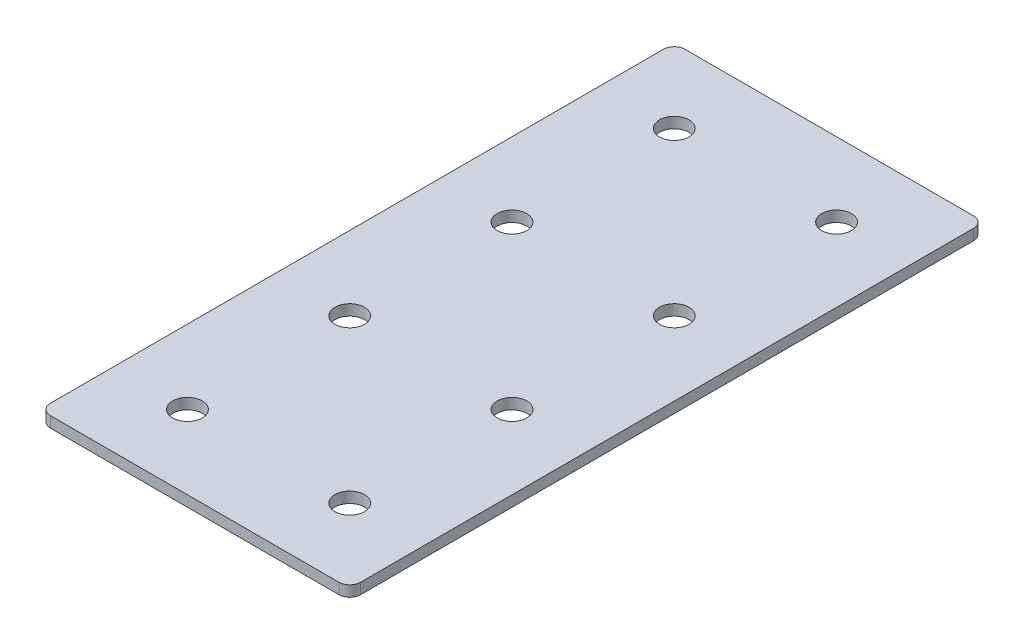
ISO-10303-21;
HEADER;
FILE_DESCRIPTION(('STEP AP214'),'2;1');
FILE_NAME('part.step','',(''),(''),'','','');
FILE_SCHEMA(('AUTOMOTIVE_DESIGN { 1 0 10303 214 1 1 1 1 }'));
ENDSEC;
DATA;
#1=APPLICATION_CONTEXT('core data for automotive mechanical design processes');
#2=APPLICATION_PROTOCOL_DEFINITION('international standard','automotive_design',2000,#1);
#3=PRODUCT_CONTEXT('',#1,'mechanical');
#4=PRODUCT('Part','Part','',(#3));
#5=PRODUCT_RELATED_PRODUCT_CATEGORY('part','',(#4));
#6=PRODUCT_DEFINITION_FORMATION('','',#4);
#7=PRODUCT_DEFINITION_CONTEXT('part definition',#1,'design');
#8=PRODUCT_DEFINITION('design','',#6,#7);
#9=PRODUCT_DEFINITION_SHAPE('','',#8);
#10=(LENGTH_UNIT() NAMED_UNIT(*) SI_UNIT(.MILLI.,.METRE.));
#11=(NAMED_UNIT(*) PLANE_ANGLE_UNIT() SI_UNIT($,.RADIAN.));
#12=(NAMED_UNIT(*) SI_UNIT($,.STERADIAN.) SOLID_ANGLE_UNIT());
#13=UNCERTAINTY_MEASURE_WITH_UNIT(LENGTH_MEASURE(1.E-05),#10,'distance_accuracy_value','');
#14=(GEOMETRIC_REPRESENTATION_CONTEXT(3) GLOBAL_UNCERTAINTY_ASSIGNED_CONTEXT((#13)) GLOBAL_UNIT_ASSIGNED_CONTEXT((#10,
#11,#12)) REPRESENTATION_CONTEXT('',''));
#15=CARTESIAN_POINT('',(0.,0.,0.));
#16=DIRECTION('',(0.,0.,1.));
#17=DIRECTION('',(1.,0.,0.));
#18=AXIS2_PLACEMENT_3D('',#15,#16,#17);
#19=CARTESIAN_POINT('',(-1.93702400832763,1.42462627726309,-68.4871269738255));
#20=DIRECTION('',(0.,-1.,0.));
#21=DIRECTION('',(0.,0.,-1.));
#22=AXIS2_PLACEMENT_3D('',#19,#20,#21);
#23=PLANE('',#22);
#24=CARTESIAN_POINT('',(20.5629759916724,1.42462627726309,66.5128730261745));
#25=DIRECTION('',(0.,1.,0.));
#26=DIRECTION('',(0.,0.,1.));
#27=AXIS2_PLACEMENT_3D('',#24,#25,#26);
#28=CIRCLE('',#27,4.1);
#29=CARTESIAN_POINT('',(20.5629759916724,1.42462627726309,70.6128730261745));
#30=VERTEX_POINT('',#29);
#31=EDGE_CURVE('E189',#30,#30,#28,.T.);
#32=ORIENTED_EDGE('',*,*,#31,.T.);
#33=EDGE_LOOP('',(#32));
#34=FACE_BOUND('',#33,.T.);
#35=CARTESIAN_POINT('',(-24.4370240083277,1.42462627726309,66.5128730261745));
#36=DIRECTION('',(0.,1.,0.));
#37=DIRECTION('',(0.,0.,1.));
#38=AXIS2_PLACEMENT_3D('',#35,#36,#37);
#39=CIRCLE('',#38,4.1);
#40=CARTESIAN_POINT('',(-24.4370240083277,1.42462627726309,70.6128730261745));
#41=VERTEX_POINT('',#40);
#42=EDGE_CURVE('E183',#41,#41,#39,.T.);
#43=ORIENTED_EDGE('',*,*,#42,.T.);
#44=EDGE_LOOP('',(#43));
#45=FACE_BOUND('',#44,.T.);
#46=CARTESIAN_POINT('',(20.5629759916724,1.42462627726309,21.5128730261745));
#47=DIRECTION('',(0.,1.,0.));
#48=DIRECTION('',(0.,0.,1.));
#49=AXIS2_PLACEMENT_3D('',#46,#47,#48);
#50=CIRCLE('',#49,4.1);
#51=CARTESIAN_POINT('',(20.5629759916724,1.42462627726309,25.6128730261745));
#52=VERTEX_POINT('',#51);
#53=EDGE_CURVE('E177',#52,#52,#50,.T.);
#54=ORIENTED_EDGE('',*,*,#53,.T.);
#55=EDGE_LOOP('',(#54));
#56=FACE_BOUND('',#55,.T.);
#57=CARTESIAN_POINT('',(-24.4370240083277,1.42462627726309,21.5128730261745));
#58=DIRECTION('',(0.,1.,0.));
#59=DIRECTION('',(0.,0.,1.));
#60=AXIS2_PLACEMENT_3D('',#57,#58,#59);
#61=CIRCLE('',#60,4.1);
#62=CARTESIAN_POINT('',(-24.4370240083277,1.42462627726309,25.6128730261745));
#63=VERTEX_POINT('',#62);
#64=EDGE_CURVE('E171',#63,#63,#61,.T.);
#65=ORIENTED_EDGE('',*,*,#64,.T.);
#66=EDGE_LOOP('',(#65));
#67=FACE_BOUND('',#66,.T.);
#68=CARTESIAN_POINT('',(20.5629759916724,1.42462627726309,-23.4871269738255));
#69=DIRECTION('',(0.,1.,0.));
#70=DIRECTION('',(0.,0.,1.));
#71=AXIS2_PLACEMENT_3D('',#68,#69,#70);
#72=CIRCLE('',#71,4.1);
#73=CARTESIAN_POINT('',(20.5629759916724,1.42462627726309,-19.3871269738255));
#74=VERTEX_POINT('',#73);
#75=EDGE_CURVE('E165',#74,#74,#72,.T.);
#76=ORIENTED_EDGE('',*,*,#75,.T.);
#77=EDGE_LOOP('',(#76));
#78=FACE_BOUND('',#77,.T.);
#79=CARTESIAN_POINT('',(-24.4370240083277,1.42462627726309,-23.4871269738255));
#80=DIRECTION('',(0.,1.,0.));
#81=DIRECTION('',(0.,0.,1.));
#82=AXIS2_PLACEMENT_3D('',#79,#80,#81);
#83=CIRCLE('',#82,4.1);
#84=CARTESIAN_POINT('',(-24.4370240083277,1.42462627726309,-19.3871269738255));
#85=VERTEX_POINT('',#84);
#86=EDGE_CURVE('E159',#85,#85,#83,.T.);
#87=ORIENTED_EDGE('',*,*,#86,.T.);
#88=EDGE_LOOP('',(#87));
#89=FACE_BOUND('',#88,.T.);
#90=CARTESIAN_POINT('',(20.5629759916724,1.42462627726309,-68.4871269738255));
#91=DIRECTION('',(0.,1.,0.));
#92=DIRECTION('',(0.,0.,1.));
#93=AXIS2_PLACEMENT_3D('',#90,#91,#92);
#94=CIRCLE('',#93,4.1);
#95=CARTESIAN_POINT('',(20.5629759916724,1.42462627726309,-64.3871269738255));
#96=VERTEX_POINT('',#95);
#97=EDGE_CURVE('E154',#96,#96,#94,.T.);
#98=ORIENTED_EDGE('',*,*,#97,.T.);
#99=EDGE_LOOP('',(#98));
#100=FACE_BOUND('',#99,.T.);
#101=CARTESIAN_POINT('',(-24.4370240083277,1.42462627726309,-68.4871269738255));
#102=DIRECTION('',(0.,1.,0.));
#103=DIRECTION('',(0.,0.,1.));
#104=AXIS2_PLACEMENT_3D('',#101,#102,#103);
#105=CIRCLE('',#104,4.1);
#106=CARTESIAN_POINT('',(-24.4370240083277,1.42462627726309,-64.3871269738255));
#107=VERTEX_POINT('',#106);
#108=EDGE_CURVE('E147',#107,#107,#105,.T.);
#109=ORIENTED_EDGE('',*,*,#108,.T.);
#110=EDGE_LOOP('',(#109));
#111=FACE_BOUND('',#110,.T.);
#112=DIRECTION('',(0.,0.,-1.));
#113=VECTOR('',#112,1.);
#114=CARTESIAN_POINT('',(41.0629759916725,1.42462627726309,87.0128730261745));
#115=LINE('',#114,#113);
#116=CARTESIAN_POINT('',(41.0629759916725,1.42462627726309,84.0128730261745));
#117=VERTEX_POINT('',#116);
#118=CARTESIAN_POINT('',(41.0629759916724,1.42462627726309,-85.9871269738255));
#119=VERTEX_POINT('',#118);
#120=EDGE_CURVE('E106',#117,#119,#115,.T.);
#121=ORIENTED_EDGE('',*,*,#120,.F.);
#122=CARTESIAN_POINT('',(38.0629759916725,1.42462627726309,84.0128730261745));
#123=DIRECTION('',(0.,-1.,0.));
#124=DIRECTION('',(0.,0.,-1.));
#125=AXIS2_PLACEMENT_3D('',#122,#123,#124);
#126=CIRCLE('',#125,3.);
#127=CARTESIAN_POINT('',(38.0629759916725,1.42462627726309,87.0128730261745));
#128=VERTEX_POINT('',#127);
#129=EDGE_CURVE('E128',#117,#128,#126,.T.);
#130=ORIENTED_EDGE('',*,*,#129,.T.);
#131=DIRECTION('',(1.,0.,0.));
#132=VECTOR('',#131,1.);
#133=CARTESIAN_POINT('',(-44.9370240083277,1.42462627726309,87.0128730261745));
#134=LINE('',#133,#132);
#135=CARTESIAN_POINT('',(-41.9370240083277,1.42462627726309,87.0128730261745));
#136=VERTEX_POINT('',#135);
#137=EDGE_CURVE('E110',#136,#128,#134,.T.);
#138=ORIENTED_EDGE('',*,*,#137,.F.);
#139=CARTESIAN_POINT('',(-41.9370240083277,1.42462627726309,84.0128730261745));
#140=DIRECTION('',(0.,-1.,0.));
#141=DIRECTION('',(0.,0.,-1.));
#142=AXIS2_PLACEMENT_3D('',#139,#140,#141);
#143=CIRCLE('',#142,3.);
#144=CARTESIAN_POINT('',(-44.9370240083277,1.42462627726309,84.0128730261745));
#145=VERTEX_POINT('',#144);
#146=EDGE_CURVE('E105',#136,#145,#143,.T.);
#147=ORIENTED_EDGE('',*,*,#146,.T.);
#148=DIRECTION('',(0.,0.,1.));
#149=VECTOR('',#148,1.);
#150=CARTESIAN_POINT('',(-44.9370240083277,1.42462627726309,-88.9871269738255));
#151=LINE('',#150,#149);
#152=CARTESIAN_POINT('',(-44.9370240083277,1.42462627726309,-85.9871269738255));
#153=VERTEX_POINT('',#152);
#154=EDGE_CURVE('E137',#153,#145,#151,.T.);
#155=ORIENTED_EDGE('',*,*,#154,.F.);
#156=CARTESIAN_POINT('',(-41.9370240083277,1.42462627726309,-85.9871269738255));
#157=DIRECTION('',(0.,-1.,0.));
#158=DIRECTION('',(0.,0.,-1.));
#159=AXIS2_PLACEMENT_3D('',#156,#157,#158);
#160=CIRCLE('',#159,3.);
#161=CARTESIAN_POINT('',(-41.9370240083277,1.42462627726309,-88.9871269738255));
#162=VERTEX_POINT('',#161);
#163=EDGE_CURVE('E31',#153,#162,#160,.T.);
#164=ORIENTED_EDGE('',*,*,#163,.T.);
#165=DIRECTION('',(-1.,0.,0.));
#166=VECTOR('',#165,1.);
#167=CARTESIAN_POINT('',(41.0629759916724,1.42462627726309,-88.9871269738255));
#168=LINE('',#167,#166);
#169=CARTESIAN_POINT('',(38.0629759916724,1.42462627726309,-88.9871269738255));
#170=VERTEX_POINT('',#169);
#171=EDGE_CURVE('E138',#170,#162,#168,.T.);
#172=ORIENTED_EDGE('',*,*,#171,.F.);
#173=CARTESIAN_POINT('',(38.0629759916724,1.42462627726309,-85.9871269738255));
#174=DIRECTION('',(0.,-1.,0.));
#175=DIRECTION('',(0.,0.,-1.));
#176=AXIS2_PLACEMENT_3D('',#173,#174,#175);
#177=CIRCLE('',#176,3.);
#178=EDGE_CURVE('E126',#170,#119,#177,.T.);
#179=ORIENTED_EDGE('',*,*,#178,.T.);
#180=EDGE_LOOP('',(#121,#130,#138,#147,#155,#164,#172,#179));
#181=FACE_BOUND('',#180,.T.);
#182=ADVANCED_FACE('F16',(#34,#45,#56,#67,#78,#89,#100,#111,#181),#23,.T.);
#183=CARTESIAN_POINT('',(41.0629759916724,1.42462627726309,-88.9871269738255));
#184=DIRECTION('',(0.,0.,-1.));
#185=DIRECTION('',(-1.,0.,0.));
#186=AXIS2_PLACEMENT_3D('',#183,#184,#185);
#187=PLANE('',#186);
#188=DIRECTION('',(-1.,0.,0.));
#189=VECTOR('',#188,1.);
#190=CARTESIAN_POINT('',(41.0629759916724,4.42462627726309,-88.9871269738255));
#191=LINE('',#190,#189);
#192=CARTESIAN_POINT('',(38.0629759916724,4.42462627726309,-88.9871269738255));
#193=VERTEX_POINT('',#192);
#194=CARTESIAN_POINT('',(-41.9370240083277,4.42462627726309,-88.9871269738255));
#195=VERTEX_POINT('',#194);
#196=EDGE_CURVE('E144',#193,#195,#191,.T.);
#197=ORIENTED_EDGE('',*,*,#196,.F.);
#198=DIRECTION('',(0.,1.,0.));
#199=VECTOR('',#198,1.);
#200=CARTESIAN_POINT('',(38.0629759916724,1.42462627726309,-88.9871269738255));
#201=LINE('',#200,#199);
#202=EDGE_CURVE('E38',#193,#170,#201,.F.);
#203=ORIENTED_EDGE('',*,*,#202,.T.);
#204=ORIENTED_EDGE('',*,*,#171,.T.);
#205=DIRECTION('',(0.,1.,0.));
#206=VECTOR('',#205,1.);
#207=CARTESIAN_POINT('',(-41.9370240083277,1.42462627726309,-88.9871269738255));
#208=LINE('',#207,#206);
#209=EDGE_CURVE('E130',#162,#195,#208,.T.);
#210=ORIENTED_EDGE('',*,*,#209,.T.);
#211=EDGE_LOOP('',(#197,#203,#204,#210));
#212=FACE_BOUND('',#211,.T.);
#213=ADVANCED_FACE('F239',(#212),#187,.T.);
#214=CARTESIAN_POINT('',(41.0629759916725,1.42462627726309,87.0128730261745));
#215=DIRECTION('',(1.,0.,0.));
#216=DIRECTION('',(0.,0.,-1.));
#217=AXIS2_PLACEMENT_3D('',#214,#215,#216);
#218=PLANE('',#217);
#219=DIRECTION('',(0.,0.,-1.));
#220=VECTOR('',#219,1.);
#221=CARTESIAN_POINT('',(41.0629759916725,4.42462627726309,87.0128730261745));
#222=LINE('',#221,#220);
#223=CARTESIAN_POINT('',(41.0629759916725,4.42462627726309,84.0128730261745));
#224=VERTEX_POINT('',#223);
#225=CARTESIAN_POINT('',(41.0629759916724,4.42462627726309,-85.9871269738255));
#226=VERTEX_POINT('',#225);
#227=EDGE_CURVE('E102',#224,#226,#222,.T.);
#228=ORIENTED_EDGE('',*,*,#227,.F.);
#229=DIRECTION('',(0.,1.,0.));
#230=VECTOR('',#229,1.);
#231=CARTESIAN_POINT('',(41.0629759916725,1.42462627726309,84.0128730261745));
#232=LINE('',#231,#230);
#233=EDGE_CURVE('E122',#224,#117,#232,.F.);
#234=ORIENTED_EDGE('',*,*,#233,.T.);
#235=ORIENTED_EDGE('',*,*,#120,.T.);
#236=DIRECTION('',(0.,1.,0.));
#237=VECTOR('',#236,1.);
#238=CARTESIAN_POINT('',(41.0629759916724,1.42462627726309,-85.9871269738255));
#239=LINE('',#238,#237);
#240=EDGE_CURVE('E119',#119,#226,#239,.T.);
#241=ORIENTED_EDGE('',*,*,#240,.T.);
#242=EDGE_LOOP('',(#228,#234,#235,#241));
#243=FACE_BOUND('',#242,.T.);
#244=ADVANCED_FACE('F244',(#243),#218,.T.);
#245=CARTESIAN_POINT('',(-44.9370240083277,1.42462627726309,87.0128730261745));
#246=DIRECTION('',(0.,0.,1.));
#247=DIRECTION('',(1.,0.,0.));
#248=AXIS2_PLACEMENT_3D('',#245,#246,#247);
#249=PLANE('',#248);
#250=ORIENTED_EDGE('',*,*,#137,.T.);
#251=DIRECTION('',(0.,1.,0.));
#252=VECTOR('',#251,1.);
#253=CARTESIAN_POINT('',(38.0629759916725,1.42462627726309,87.0128730261745));
#254=LINE('',#253,#252);
#255=CARTESIAN_POINT('',(38.0629759916725,4.42462627726309,87.0128730261745));
#256=VERTEX_POINT('',#255);
#257=EDGE_CURVE('E93',#128,#256,#254,.T.);
#258=ORIENTED_EDGE('',*,*,#257,.T.);
#259=DIRECTION('',(1.,0.,0.));
#260=VECTOR('',#259,1.);
#261=CARTESIAN_POINT('',(-44.9370240083277,4.42462627726309,87.0128730261745));
#262=LINE('',#261,#260);
#263=CARTESIAN_POINT('',(-41.9370240083277,4.42462627726309,87.0128730261745));
#264=VERTEX_POINT('',#263);
#265=EDGE_CURVE('E85',#264,#256,#262,.T.);
#266=ORIENTED_EDGE('',*,*,#265,.F.);
#267=DIRECTION('',(0.,1.,0.));
#268=VECTOR('',#267,1.);
#269=CARTESIAN_POINT('',(-41.9370240083277,1.42462627726309,87.0128730261745));
#270=LINE('',#269,#268);
#271=EDGE_CURVE('E99',#264,#136,#270,.F.);
#272=ORIENTED_EDGE('',*,*,#271,.T.);
#273=EDGE_LOOP('',(#250,#258,#266,#272));
#274=FACE_BOUND('',#273,.T.);
#275=ADVANCED_FACE('F98',(#274),#249,.T.);
#276=CARTESIAN_POINT('',(-44.9370240083277,1.42462627726309,-88.9871269738255));
#277=DIRECTION('',(-1.,0.,0.));
#278=DIRECTION('',(0.,0.,1.));
#279=AXIS2_PLACEMENT_3D('',#276,#277,#278);
#280=PLANE('',#279);
#281=DIRECTION('',(0.,0.,1.));
#282=VECTOR('',#281,1.);
#283=CARTESIAN_POINT('',(-44.9370240083277,4.42462627726309,-88.9871269738255));
#284=LINE('',#283,#282);
#285=CARTESIAN_POINT('',(-44.9370240083277,4.42462627726309,-85.9871269738255));
#286=VERTEX_POINT('',#285);
#287=CARTESIAN_POINT('',(-44.9370240083277,4.42462627726309,84.0128730261745));
#288=VERTEX_POINT('',#287);
#289=EDGE_CURVE('E87',#286,#288,#284,.T.);
#290=ORIENTED_EDGE('',*,*,#289,.F.);
#291=DIRECTION('',(0.,1.,0.));
#292=VECTOR('',#291,1.);
#293=CARTESIAN_POINT('',(-44.9370240083277,1.42462627726309,-85.9871269738255));
#294=LINE('',#293,#292);
#295=EDGE_CURVE('E10',#286,#153,#294,.F.);
#296=ORIENTED_EDGE('',*,*,#295,.T.);
#297=ORIENTED_EDGE('',*,*,#154,.T.);
#298=DIRECTION('',(0.,1.,0.));
#299=VECTOR('',#298,1.);
#300=CARTESIAN_POINT('',(-44.9370240083277,1.42462627726309,84.0128730261745));
#301=LINE('',#300,#299);
#302=EDGE_CURVE('E24',#145,#288,#301,.T.);
#303=ORIENTED_EDGE('',*,*,#302,.T.);
#304=EDGE_LOOP('',(#290,#296,#297,#303));
#305=FACE_BOUND('',#304,.T.);
#306=ADVANCED_FACE('F135',(#305),#280,.T.);
#307=CARTESIAN_POINT('',(-1.93702400832763,4.42462627726309,-68.4871269738255));
#308=DIRECTION('',(0.,-1.,0.));
#309=DIRECTION('',(0.,0.,-1.));
#310=AXIS2_PLACEMENT_3D('',#307,#308,#309);
#311=PLANE('',#310);
#312=CARTESIAN_POINT('',(20.5629759916724,4.42462627726309,66.5128730261745));
#313=DIRECTION('',(0.,1.,0.));
#314=DIRECTION('',(0.,0.,1.));
#315=AXIS2_PLACEMENT_3D('',#312,#313,#314);
#316=CIRCLE('',#315,4.1);
#317=CARTESIAN_POINT('',(20.5629759916724,4.42462627726309,70.6128730261745));
#318=VERTEX_POINT('',#317);
#319=EDGE_CURVE('E192',#318,#318,#316,.T.);
#320=ORIENTED_EDGE('',*,*,#319,.F.);
#321=EDGE_LOOP('',(#320));
#322=FACE_BOUND('',#321,.T.);
#323=CARTESIAN_POINT('',(-24.4370240083277,4.42462627726309,66.5128730261745));
#324=DIRECTION('',(0.,1.,0.));
#325=DIRECTION('',(0.,0.,1.));
#326=AXIS2_PLACEMENT_3D('',#323,#324,#325);
#327=CIRCLE('',#326,4.1);
#328=CARTESIAN_POINT('',(-24.4370240083277,4.42462627726309,70.6128730261745));
#329=VERTEX_POINT('',#328);
#330=EDGE_CURVE('E186',#329,#329,#327,.T.);
#331=ORIENTED_EDGE('',*,*,#330,.F.);
#332=EDGE_LOOP('',(#331));
#333=FACE_BOUND('',#332,.T.);
#334=CARTESIAN_POINT('',(20.5629759916724,4.42462627726309,21.5128730261745));
#335=DIRECTION('',(0.,1.,0.));
#336=DIRECTION('',(0.,0.,1.));
#337=AXIS2_PLACEMENT_3D('',#334,#335,#336);
#338=CIRCLE('',#337,4.1);
#339=CARTESIAN_POINT('',(20.5629759916724,4.42462627726309,25.6128730261745));
#340=VERTEX_POINT('',#339);
#341=EDGE_CURVE('E180',#340,#340,#338,.T.);
#342=ORIENTED_EDGE('',*,*,#341,.F.);
#343=EDGE_LOOP('',(#342));
#344=FACE_BOUND('',#343,.T.);
#345=CARTESIAN_POINT('',(-24.4370240083277,4.42462627726309,21.5128730261745));
#346=DIRECTION('',(0.,1.,0.));
#347=DIRECTION('',(0.,0.,1.));
#348=AXIS2_PLACEMENT_3D('',#345,#346,#347);
#349=CIRCLE('',#348,4.1);
#350=CARTESIAN_POINT('',(-24.4370240083277,4.42462627726309,25.6128730261745));
#351=VERTEX_POINT('',#350);
#352=EDGE_CURVE('E174',#351,#351,#349,.T.);
#353=ORIENTED_EDGE('',*,*,#352,.F.);
#354=EDGE_LOOP('',(#353));
#355=FACE_BOUND('',#354,.T.);
#356=CARTESIAN_POINT('',(20.5629759916724,4.42462627726309,-23.4871269738255));
#357=DIRECTION('',(0.,1.,0.));
#358=DIRECTION('',(0.,0.,1.));
#359=AXIS2_PLACEMENT_3D('',#356,#357,#358);
#360=CIRCLE('',#359,4.1);
#361=CARTESIAN_POINT('',(20.5629759916724,4.42462627726309,-19.3871269738255));
#362=VERTEX_POINT('',#361);
#363=EDGE_CURVE('E168',#362,#362,#360,.T.);
#364=ORIENTED_EDGE('',*,*,#363,.F.);
#365=EDGE_LOOP('',(#364));
#366=FACE_BOUND('',#365,.T.);
#367=CARTESIAN_POINT('',(-24.4370240083277,4.42462627726309,-23.4871269738255));
#368=DIRECTION('',(0.,1.,0.));
#369=DIRECTION('',(0.,0.,1.));
#370=AXIS2_PLACEMENT_3D('',#367,#368,#369);
#371=CIRCLE('',#370,4.1);
#372=CARTESIAN_POINT('',(-24.4370240083277,4.42462627726309,-19.3871269738255));
#373=VERTEX_POINT('',#372);
#374=EDGE_CURVE('E162',#373,#373,#371,.T.);
#375=ORIENTED_EDGE('',*,*,#374,.F.);
#376=EDGE_LOOP('',(#375));
#377=FACE_BOUND('',#376,.T.);
#378=CARTESIAN_POINT('',(20.5629759916724,4.42462627726309,-68.4871269738255));
#379=DIRECTION('',(0.,1.,0.));
#380=DIRECTION('',(0.,0.,1.));
#381=AXIS2_PLACEMENT_3D('',#378,#379,#380);
#382=CIRCLE('',#381,4.1);
#383=CARTESIAN_POINT('',(20.5629759916724,4.42462627726309,-64.3871269738255));
#384=VERTEX_POINT('',#383);
#385=EDGE_CURVE('E156',#384,#384,#382,.T.);
#386=ORIENTED_EDGE('',*,*,#385,.F.);
#387=EDGE_LOOP('',(#386));
#388=FACE_BOUND('',#387,.T.);
#389=CARTESIAN_POINT('',(-24.4370240083277,4.42462627726309,-68.4871269738255));
#390=DIRECTION('',(0.,1.,0.));
#391=DIRECTION('',(0.,0.,1.));
#392=AXIS2_PLACEMENT_3D('',#389,#390,#391);
#393=CIRCLE('',#392,4.1);
#394=CARTESIAN_POINT('',(-24.4370240083277,4.42462627726309,-64.3871269738255));
#395=VERTEX_POINT('',#394);
#396=EDGE_CURVE('E149',#395,#395,#393,.T.);
#397=ORIENTED_EDGE('',*,*,#396,.F.);
#398=EDGE_LOOP('',(#397));
#399=FACE_BOUND('',#398,.T.);
#400=ORIENTED_EDGE('',*,*,#265,.T.);
#401=CARTESIAN_POINT('',(38.0629759916725,4.42462627726309,84.0128730261745));
#402=DIRECTION('',(0.,-1.,0.));
#403=DIRECTION('',(0.,0.,-1.));
#404=AXIS2_PLACEMENT_3D('',#401,#402,#403);
#405=CIRCLE('',#404,3.);
#406=EDGE_CURVE('E117',#256,#224,#405,.F.);
#407=ORIENTED_EDGE('',*,*,#406,.T.);
#408=ORIENTED_EDGE('',*,*,#227,.T.);
#409=CARTESIAN_POINT('',(38.0629759916724,4.42462627726309,-85.9871269738255));
#410=DIRECTION('',(0.,-1.,0.));
#411=DIRECTION('',(0.,0.,-1.));
#412=AXIS2_PLACEMENT_3D('',#409,#410,#411);
#413=CIRCLE('',#412,3.);
#414=EDGE_CURVE('E115',#226,#193,#413,.F.);
#415=ORIENTED_EDGE('',*,*,#414,.T.);
#416=ORIENTED_EDGE('',*,*,#196,.T.);
#417=CARTESIAN_POINT('',(-41.9370240083277,4.42462627726309,-85.9871269738255));
#418=DIRECTION('',(0.,-1.,0.));
#419=DIRECTION('',(0.,0.,-1.));
#420=AXIS2_PLACEMENT_3D('',#417,#418,#419);
#421=CIRCLE('',#420,3.);
#422=EDGE_CURVE('E92',#195,#286,#421,.F.);
#423=ORIENTED_EDGE('',*,*,#422,.T.);
#424=ORIENTED_EDGE('',*,*,#289,.T.);
#425=CARTESIAN_POINT('',(-41.9370240083277,4.42462627726309,84.0128730261745));
#426=DIRECTION('',(0.,-1.,0.));
#427=DIRECTION('',(0.,0.,-1.));
#428=AXIS2_PLACEMENT_3D('',#425,#426,#427);
#429=CIRCLE('',#428,3.);
#430=EDGE_CURVE('E82',#288,#264,#429,.F.);
#431=ORIENTED_EDGE('',*,*,#430,.T.);
#432=EDGE_LOOP('',(#400,#407,#408,#415,#416,#423,#424,#431));
#433=FACE_BOUND('',#432,.T.);
#434=ADVANCED_FACE('F84',(#322,#333,#344,#355,#366,#377,#388,#399,#433),#311,.F.);
#435=CARTESIAN_POINT('',(-24.4370240083277,1.42462627726309,-68.4871269738255));
#436=DIRECTION('',(0.,1.,0.));
#437=DIRECTION('',(0.,0.,1.));
#438=AXIS2_PLACEMENT_3D('',#435,#436,#437);
#439=CYLINDRICAL_SURFACE('',#438,4.1);
#440=ORIENTED_EDGE('',*,*,#108,.F.);
#441=EDGE_LOOP('',(#440));
#442=FACE_BOUND('',#441,.T.);
#443=ORIENTED_EDGE('',*,*,#396,.T.);
#444=EDGE_LOOP('',(#443));
#445=FACE_BOUND('',#444,.T.);
#446=ADVANCED_FACE('F210',(#442,#445),#439,.F.);
#447=CARTESIAN_POINT('',(20.5629759916724,1.42462627726309,-68.4871269738255));
#448=DIRECTION('',(0.,1.,0.));
#449=DIRECTION('',(0.,0.,1.));
#450=AXIS2_PLACEMENT_3D('',#447,#448,#449);
#451=CYLINDRICAL_SURFACE('',#450,4.1);
#452=ORIENTED_EDGE('',*,*,#97,.F.);
#453=EDGE_LOOP('',(#452));
#454=FACE_BOUND('',#453,.T.);
#455=ORIENTED_EDGE('',*,*,#385,.T.);
#456=EDGE_LOOP('',(#455));
#457=FACE_BOUND('',#456,.T.);
#458=ADVANCED_FACE('F227',(#454,#457),#451,.F.);
#459=CARTESIAN_POINT('',(-24.4370240083277,1.42462627726309,-23.4871269738255));
#460=DIRECTION('',(0.,1.,0.));
#461=DIRECTION('',(0.,0.,1.));
#462=AXIS2_PLACEMENT_3D('',#459,#460,#461);
#463=CYLINDRICAL_SURFACE('',#462,4.1);
#464=ORIENTED_EDGE('',*,*,#86,.F.);
#465=EDGE_LOOP('',(#464));
#466=FACE_BOUND('',#465,.T.);
#467=ORIENTED_EDGE('',*,*,#374,.T.);
#468=EDGE_LOOP('',(#467));
#469=FACE_BOUND('',#468,.T.);
#470=ADVANCED_FACE('F234',(#466,#469),#463,.F.);
#471=CARTESIAN_POINT('',(20.5629759916724,1.42462627726309,-23.4871269738255));
#472=DIRECTION('',(0.,1.,0.));
#473=DIRECTION('',(0.,0.,1.));
#474=AXIS2_PLACEMENT_3D('',#471,#472,#473);
#475=CYLINDRICAL_SURFACE('',#474,4.1);
#476=ORIENTED_EDGE('',*,*,#75,.F.);
#477=EDGE_LOOP('',(#476));
#478=FACE_BOUND('',#477,.T.);
#479=ORIENTED_EDGE('',*,*,#363,.T.);
#480=EDGE_LOOP('',(#479));
#481=FACE_BOUND('',#480,.T.);
#482=ADVANCED_FACE('F307',(#478,#481),#475,.F.);
#483=CARTESIAN_POINT('',(-24.4370240083277,1.42462627726309,21.5128730261745));
#484=DIRECTION('',(0.,1.,0.));
#485=DIRECTION('',(0.,0.,1.));
#486=AXIS2_PLACEMENT_3D('',#483,#484,#485);
#487=CYLINDRICAL_SURFACE('',#486,4.1);
#488=ORIENTED_EDGE('',*,*,#64,.F.);
#489=EDGE_LOOP('',(#488));
#490=FACE_BOUND('',#489,.T.);
#491=ORIENTED_EDGE('',*,*,#352,.T.);
#492=EDGE_LOOP('',(#491));
#493=FACE_BOUND('',#492,.T.);
#494=ADVANCED_FACE('F317',(#490,#493),#487,.F.);
#495=CARTESIAN_POINT('',(20.5629759916724,1.42462627726309,21.5128730261745));
#496=DIRECTION('',(0.,1.,0.));
#497=DIRECTION('',(0.,0.,1.));
#498=AXIS2_PLACEMENT_3D('',#495,#496,#497);
#499=CYLINDRICAL_SURFACE('',#498,4.1);
#500=ORIENTED_EDGE('',*,*,#53,.F.);
#501=EDGE_LOOP('',(#500));
#502=FACE_BOUND('',#501,.T.);
#503=ORIENTED_EDGE('',*,*,#341,.T.);
#504=EDGE_LOOP('',(#503));
#505=FACE_BOUND('',#504,.T.);
#506=ADVANCED_FACE('F327',(#502,#505),#499,.F.);
#507=CARTESIAN_POINT('',(-24.4370240083277,1.42462627726309,66.5128730261745));
#508=DIRECTION('',(0.,1.,0.));
#509=DIRECTION('',(0.,0.,1.));
#510=AXIS2_PLACEMENT_3D('',#507,#508,#509);
#511=CYLINDRICAL_SURFACE('',#510,4.1);
#512=ORIENTED_EDGE('',*,*,#42,.F.);
#513=EDGE_LOOP('',(#512));
#514=FACE_BOUND('',#513,.T.);
#515=ORIENTED_EDGE('',*,*,#330,.T.);
#516=EDGE_LOOP('',(#515));
#517=FACE_BOUND('',#516,.T.);
#518=ADVANCED_FACE('F204',(#514,#517),#511,.F.);
#519=CARTESIAN_POINT('',(20.5629759916724,1.42462627726309,66.5128730261745));
#520=DIRECTION('',(0.,1.,0.));
#521=DIRECTION('',(0.,0.,1.));
#522=AXIS2_PLACEMENT_3D('',#519,#520,#521);
#523=CYLINDRICAL_SURFACE('',#522,4.1);
#524=ORIENTED_EDGE('',*,*,#31,.F.);
#525=EDGE_LOOP('',(#524));
#526=FACE_BOUND('',#525,.T.);
#527=ORIENTED_EDGE('',*,*,#319,.T.);
#528=EDGE_LOOP('',(#527));
#529=FACE_BOUND('',#528,.T.);
#530=ADVANCED_FACE('F200',(#526,#529),#523,.F.);
#531=CARTESIAN_POINT('',(38.0629759916725,1.42462627726309,84.0128730261745));
#532=DIRECTION('',(0.,1.,0.));
#533=DIRECTION('',(0.,0.,1.));
#534=AXIS2_PLACEMENT_3D('',#531,#532,#533);
#535=CYLINDRICAL_SURFACE('',#534,3.);
#536=ORIENTED_EDGE('',*,*,#129,.F.);
#537=ORIENTED_EDGE('',*,*,#233,.F.);
#538=ORIENTED_EDGE('',*,*,#406,.F.);
#539=ORIENTED_EDGE('',*,*,#257,.F.);
#540=EDGE_LOOP('',(#536,#537,#538,#539));
#541=FACE_BOUND('',#540,.T.);
#542=ADVANCED_FACE('F203',(#541),#535,.T.);
#543=CARTESIAN_POINT('',(38.0629759916724,1.42462627726309,-85.9871269738255));
#544=DIRECTION('',(0.,1.,0.));
#545=DIRECTION('',(0.,0.,1.));
#546=AXIS2_PLACEMENT_3D('',#543,#544,#545);
#547=CYLINDRICAL_SURFACE('',#546,3.);
#548=ORIENTED_EDGE('',*,*,#178,.F.);
#549=ORIENTED_EDGE('',*,*,#202,.F.);
#550=ORIENTED_EDGE('',*,*,#414,.F.);
#551=ORIENTED_EDGE('',*,*,#240,.F.);
#552=EDGE_LOOP('',(#548,#549,#550,#551));
#553=FACE_BOUND('',#552,.T.);
#554=ADVANCED_FACE('F249',(#553),#547,.T.);
#555=CARTESIAN_POINT('',(-41.9370240083277,1.42462627726309,-85.9871269738255));
#556=DIRECTION('',(0.,1.,0.));
#557=DIRECTION('',(0.,0.,1.));
#558=AXIS2_PLACEMENT_3D('',#555,#556,#557);
#559=CYLINDRICAL_SURFACE('',#558,3.);
#560=ORIENTED_EDGE('',*,*,#163,.F.);
#561=ORIENTED_EDGE('',*,*,#295,.F.);
#562=ORIENTED_EDGE('',*,*,#422,.F.);
#563=ORIENTED_EDGE('',*,*,#209,.F.);
#564=EDGE_LOOP('',(#560,#561,#562,#563));
#565=FACE_BOUND('',#564,.T.);
#566=ADVANCED_FACE('F252',(#565),#559,.T.);
#567=CARTESIAN_POINT('',(-41.9370240083277,1.42462627726309,84.0128730261745));
#568=DIRECTION('',(0.,1.,0.));
#569=DIRECTION('',(0.,0.,1.));
#570=AXIS2_PLACEMENT_3D('',#567,#568,#569);
#571=CYLINDRICAL_SURFACE('',#570,3.);
#572=ORIENTED_EDGE('',*,*,#146,.F.);
#573=ORIENTED_EDGE('',*,*,#271,.F.);
#574=ORIENTED_EDGE('',*,*,#430,.F.);
#575=ORIENTED_EDGE('',*,*,#302,.F.);
#576=EDGE_LOOP('',(#572,#573,#574,#575));
#577=FACE_BOUND('',#576,.T.);
#578=ADVANCED_FACE('F18',(#577),#571,.T.);
#579=CLOSED_SHELL('',(#182,#213,#244,#275,#306,#434,#446,#458,#470,#482,#494,#506,#518,#530,
#542,#554,#566,#578));
#580=MANIFOLD_SOLID_BREP('B1',#579);
#581=ADVANCED_BREP_SHAPE_REPRESENTATION('',(#18,#580),#14);
#582=SHAPE_DEFINITION_REPRESENTATION(#9,#581);
ENDSEC;
END-ISO-10303-21;
